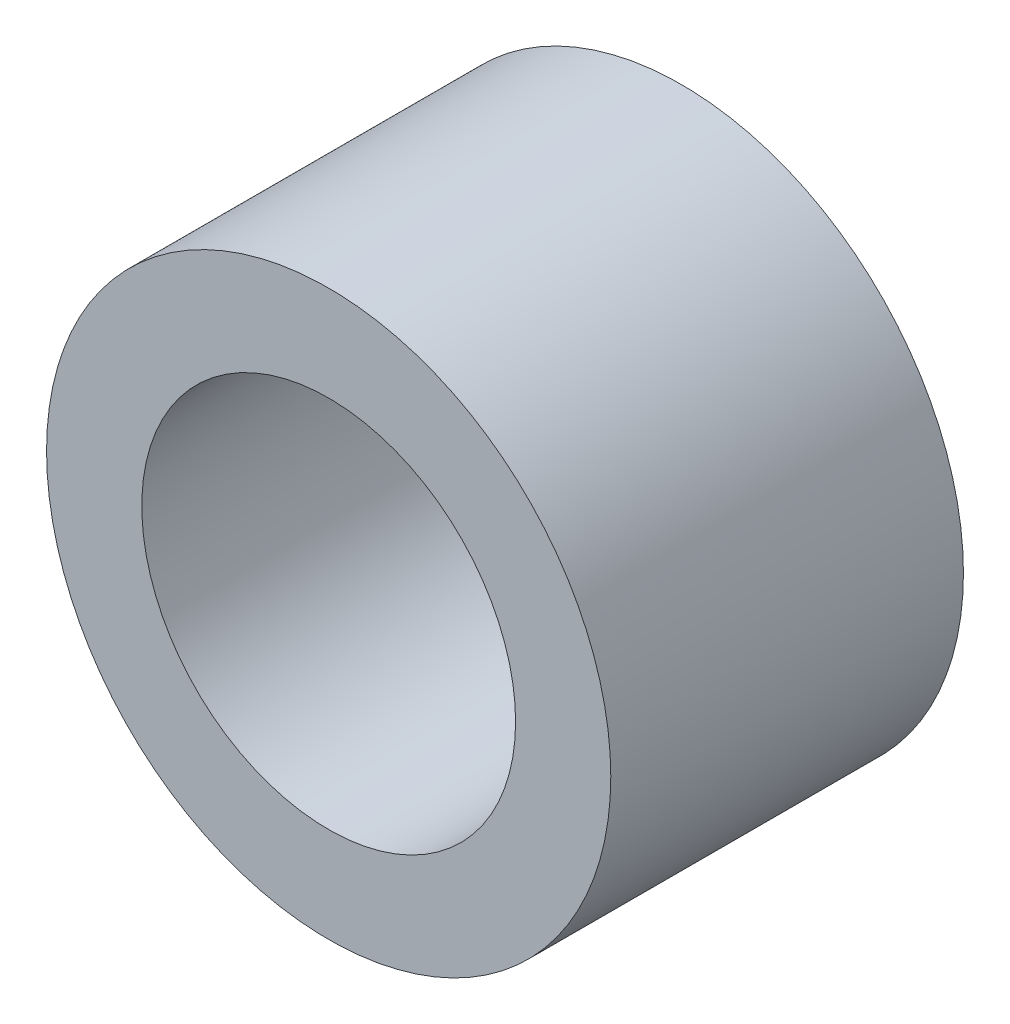
ISO-10303-21;
HEADER;
FILE_DESCRIPTION(('STEP AP214'),'2;1');
FILE_NAME('part.step','',(''),(''),'','','');
FILE_SCHEMA(('AUTOMOTIVE_DESIGN { 1 0 10303 214 1 1 1 1 }'));
ENDSEC;
DATA;
#1=APPLICATION_CONTEXT('core data for automotive mechanical design processes');
#2=APPLICATION_PROTOCOL_DEFINITION('international standard','automotive_design',2000,#1);
#3=PRODUCT_CONTEXT('',#1,'mechanical');
#4=PRODUCT('Part','Part','',(#3));
#5=PRODUCT_RELATED_PRODUCT_CATEGORY('part','',(#4));
#6=PRODUCT_DEFINITION_FORMATION('','',#4);
#7=PRODUCT_DEFINITION_CONTEXT('part definition',#1,'design');
#8=PRODUCT_DEFINITION('design','',#6,#7);
#9=PRODUCT_DEFINITION_SHAPE('','',#8);
#10=(LENGTH_UNIT() NAMED_UNIT(*) SI_UNIT(.MILLI.,.METRE.));
#11=(NAMED_UNIT(*) PLANE_ANGLE_UNIT() SI_UNIT($,.RADIAN.));
#12=(NAMED_UNIT(*) SI_UNIT($,.STERADIAN.) SOLID_ANGLE_UNIT());
#13=UNCERTAINTY_MEASURE_WITH_UNIT(LENGTH_MEASURE(1.E-05),#10,'distance_accuracy_value','');
#14=(GEOMETRIC_REPRESENTATION_CONTEXT(3) GLOBAL_UNCERTAINTY_ASSIGNED_CONTEXT((#13)) GLOBAL_UNIT_ASSIGNED_CONTEXT((#10,
#11,#12)) REPRESENTATION_CONTEXT('',''));
#15=CARTESIAN_POINT('',(0.,0.,0.));
#16=DIRECTION('',(0.,0.,1.));
#17=DIRECTION('',(1.,0.,0.));
#18=AXIS2_PLACEMENT_3D('',#15,#16,#17);
#19=CARTESIAN_POINT('',(0.,0.,2.5));
#20=DIRECTION('',(0.,0.,1.));
#21=DIRECTION('',(1.,0.,0.));
#22=AXIS2_PLACEMENT_3D('',#19,#20,#21);
#23=PLANE('',#22);
#24=CARTESIAN_POINT('',(0.,0.,2.5));
#25=DIRECTION('',(0.,0.,1.));
#26=DIRECTION('',(1.,0.,0.));
#27=AXIS2_PLACEMENT_3D('',#24,#25,#26);
#28=CIRCLE('',#27,4.);
#29=CARTESIAN_POINT('',(4.,0.,2.5));
#30=VERTEX_POINT('',#29);
#31=EDGE_CURVE('E10',#30,#30,#28,.T.);
#32=ORIENTED_EDGE('',*,*,#31,.T.);
#33=EDGE_LOOP('',(#32));
#34=FACE_BOUND('',#33,.T.);
#35=CARTESIAN_POINT('',(0.,0.,2.5));
#36=DIRECTION('',(0.,0.,1.));
#37=DIRECTION('',(1.,0.,0.));
#38=AXIS2_PLACEMENT_3D('',#35,#36,#37);
#39=CIRCLE('',#38,2.65);
#40=CARTESIAN_POINT('',(2.65,0.,2.5));
#41=VERTEX_POINT('',#40);
#42=EDGE_CURVE('E36',#41,#41,#39,.T.);
#43=ORIENTED_EDGE('',*,*,#42,.F.);
#44=EDGE_LOOP('',(#43));
#45=FACE_BOUND('',#44,.T.);
#46=ADVANCED_FACE('F29',(#34,#45),#23,.T.);
#47=CARTESIAN_POINT('',(0.,0.,2.5));
#48=DIRECTION('',(0.,0.,-1.));
#49=DIRECTION('',(-1.,0.,0.));
#50=AXIS2_PLACEMENT_3D('',#47,#48,#49);
#51=CYLINDRICAL_SURFACE('',#50,4.);
#52=ORIENTED_EDGE('',*,*,#31,.F.);
#53=EDGE_LOOP('',(#52));
#54=FACE_BOUND('',#53,.T.);
#55=CARTESIAN_POINT('',(0.,0.,-2.5));
#56=DIRECTION('',(0.,0.,1.));
#57=DIRECTION('',(1.,0.,0.));
#58=AXIS2_PLACEMENT_3D('',#55,#56,#57);
#59=CIRCLE('',#58,4.);
#60=CARTESIAN_POINT('',(4.,0.,-2.5));
#61=VERTEX_POINT('',#60);
#62=EDGE_CURVE('E40',#61,#61,#59,.T.);
#63=ORIENTED_EDGE('',*,*,#62,.T.);
#64=EDGE_LOOP('',(#63));
#65=FACE_BOUND('',#64,.T.);
#66=ADVANCED_FACE('F31',(#54,#65),#51,.T.);
#67=CARTESIAN_POINT('',(0.,0.,2.5));
#68=DIRECTION('',(0.,0.,-1.));
#69=DIRECTION('',(-1.,0.,0.));
#70=AXIS2_PLACEMENT_3D('',#67,#68,#69);
#71=CYLINDRICAL_SURFACE('',#70,2.65);
#72=ORIENTED_EDGE('',*,*,#42,.T.);
#73=EDGE_LOOP('',(#72));
#74=FACE_BOUND('',#73,.T.);
#75=CARTESIAN_POINT('',(0.,0.,-2.5));
#76=DIRECTION('',(0.,0.,1.));
#77=DIRECTION('',(1.,0.,0.));
#78=AXIS2_PLACEMENT_3D('',#75,#76,#77);
#79=CIRCLE('',#78,2.65);
#80=CARTESIAN_POINT('',(2.65,0.,-2.5));
#81=VERTEX_POINT('',#80);
#82=EDGE_CURVE('E44',#81,#81,#79,.T.);
#83=ORIENTED_EDGE('',*,*,#82,.F.);
#84=EDGE_LOOP('',(#83));
#85=FACE_BOUND('',#84,.T.);
#86=ADVANCED_FACE('F53',(#74,#85),#71,.F.);
#87=CARTESIAN_POINT('',(0.,0.,-2.5));
#88=DIRECTION('',(0.,0.,1.));
#89=DIRECTION('',(1.,0.,0.));
#90=AXIS2_PLACEMENT_3D('',#87,#88,#89);
#91=PLANE('',#90);
#92=ORIENTED_EDGE('',*,*,#82,.T.);
#93=EDGE_LOOP('',(#92));
#94=FACE_BOUND('',#93,.T.);
#95=ORIENTED_EDGE('',*,*,#62,.F.);
#96=EDGE_LOOP('',(#95));
#97=FACE_BOUND('',#96,.T.);
#98=ADVANCED_FACE('F50',(#94,#97),#91,.F.);
#99=CLOSED_SHELL('',(#46,#66,#86,#98));
#100=MANIFOLD_SOLID_BREP('B2',#99);
#101=ADVANCED_BREP_SHAPE_REPRESENTATION('',(#18,#100),#14);
#102=SHAPE_DEFINITION_REPRESENTATION(#9,#101);
ENDSEC;
END-ISO-10303-21;
